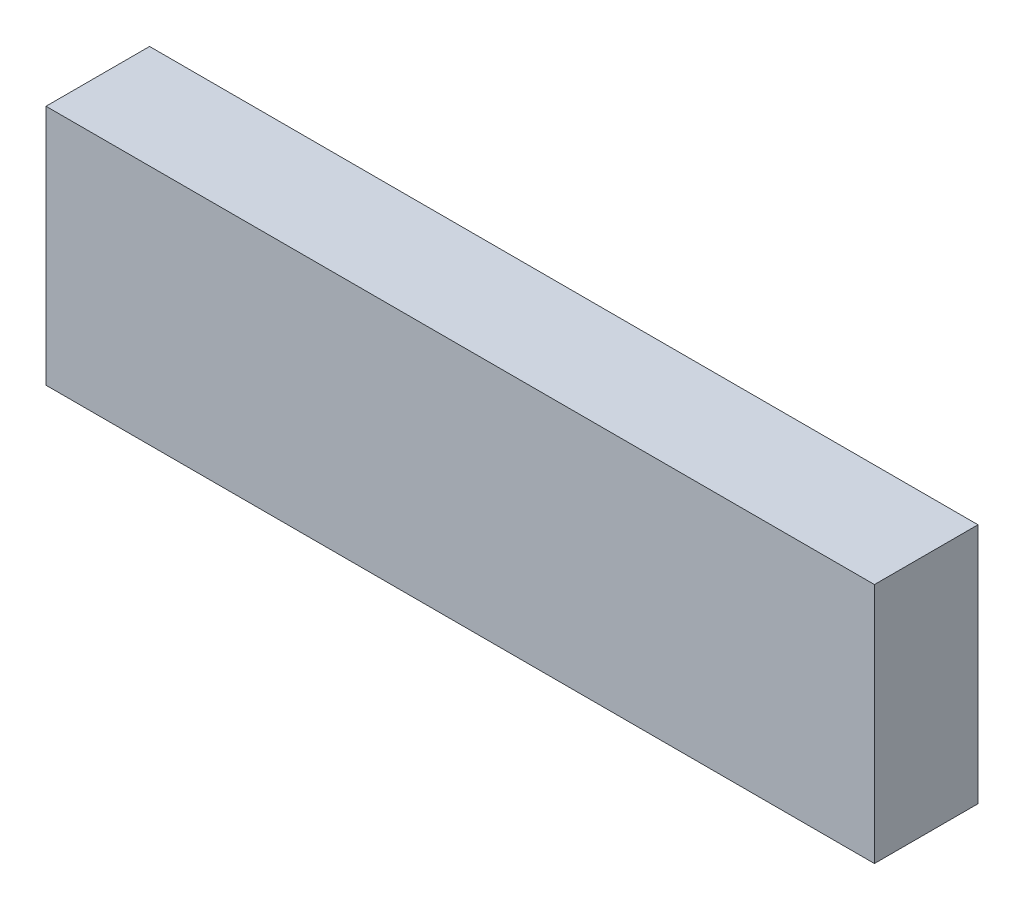
ISO-10303-21;
HEADER;
FILE_DESCRIPTION(('STEP AP214'),'2;1');
FILE_NAME('part.step','',(''),(''),'','','');
FILE_SCHEMA(('AUTOMOTIVE_DESIGN { 1 0 10303 214 1 1 1 1 }'));
ENDSEC;
DATA;
#1=APPLICATION_CONTEXT('core data for automotive mechanical design processes');
#2=APPLICATION_PROTOCOL_DEFINITION('international standard','automotive_design',2000,#1);
#3=PRODUCT_CONTEXT('',#1,'mechanical');
#4=PRODUCT('Part','Part','',(#3));
#5=PRODUCT_RELATED_PRODUCT_CATEGORY('part','',(#4));
#6=PRODUCT_DEFINITION_FORMATION('','',#4);
#7=PRODUCT_DEFINITION_CONTEXT('part definition',#1,'design');
#8=PRODUCT_DEFINITION('design','',#6,#7);
#9=PRODUCT_DEFINITION_SHAPE('','',#8);
#10=(LENGTH_UNIT() NAMED_UNIT(*) SI_UNIT(.MILLI.,.METRE.));
#11=(NAMED_UNIT(*) PLANE_ANGLE_UNIT() SI_UNIT($,.RADIAN.));
#12=(NAMED_UNIT(*) SI_UNIT($,.STERADIAN.) SOLID_ANGLE_UNIT());
#13=UNCERTAINTY_MEASURE_WITH_UNIT(LENGTH_MEASURE(1.E-05),#10,'distance_accuracy_value','');
#14=(GEOMETRIC_REPRESENTATION_CONTEXT(3) GLOBAL_UNCERTAINTY_ASSIGNED_CONTEXT((#13)) GLOBAL_UNIT_ASSIGNED_CONTEXT((#10,
#11,#12)) REPRESENTATION_CONTEXT('',''));
#15=CARTESIAN_POINT('',(0.,0.,0.));
#16=DIRECTION('',(0.,0.,1.));
#17=DIRECTION('',(1.,0.,0.));
#18=AXIS2_PLACEMENT_3D('',#15,#16,#17);
#19=CARTESIAN_POINT('',(304.8,-44.45,-19.05));
#20=DIRECTION('',(0.,0.,1.));
#21=DIRECTION('',(1.,0.,0.));
#22=AXIS2_PLACEMENT_3D('',#19,#20,#21);
#23=PLANE('',#22);
#24=DIRECTION('',(0.,1.,0.));
#25=VECTOR('',#24,1.);
#26=CARTESIAN_POINT('',(0.,-44.45,-19.05));
#27=LINE('',#26,#25);
#28=CARTESIAN_POINT('',(0.,-44.45,-19.05));
#29=VERTEX_POINT('',#28);
#30=CARTESIAN_POINT('',(0.,44.45,-19.05));
#31=VERTEX_POINT('',#30);
#32=EDGE_CURVE('E96',#29,#31,#27,.T.);
#33=ORIENTED_EDGE('',*,*,#32,.T.);
#34=DIRECTION('',(-1.,0.,0.));
#35=VECTOR('',#34,1.);
#36=CARTESIAN_POINT('',(304.8,44.45,-19.05));
#37=LINE('',#36,#35);
#38=CARTESIAN_POINT('',(304.8,44.45,-19.05));
#39=VERTEX_POINT('',#38);
#40=EDGE_CURVE('E11',#39,#31,#37,.T.);
#41=ORIENTED_EDGE('',*,*,#40,.F.);
#42=DIRECTION('',(0.,1.,0.));
#43=VECTOR('',#42,1.);
#44=CARTESIAN_POINT('',(304.8,-44.45,-19.05));
#45=LINE('',#44,#43);
#46=CARTESIAN_POINT('',(304.8,-44.45,-19.05));
#47=VERTEX_POINT('',#46);
#48=EDGE_CURVE('E84',#47,#39,#45,.T.);
#49=ORIENTED_EDGE('',*,*,#48,.F.);
#50=DIRECTION('',(-1.,0.,0.));
#51=VECTOR('',#50,1.);
#52=CARTESIAN_POINT('',(304.8,-44.45,-19.05));
#53=LINE('',#52,#51);
#54=EDGE_CURVE('E92',#47,#29,#53,.T.);
#55=ORIENTED_EDGE('',*,*,#54,.T.);
#56=EDGE_LOOP('',(#33,#41,#49,#55));
#57=FACE_BOUND('',#56,.T.);
#58=ADVANCED_FACE('F33',(#57),#23,.F.);
#59=CARTESIAN_POINT('',(304.8,44.45,19.05));
#60=DIRECTION('',(0.,-1.,0.));
#61=DIRECTION('',(0.,0.,-1.));
#62=AXIS2_PLACEMENT_3D('',#59,#60,#61);
#63=PLANE('',#62);
#64=DIRECTION('',(0.,0.,1.));
#65=VECTOR('',#64,1.);
#66=CARTESIAN_POINT('',(0.,44.45,19.05));
#67=LINE('',#66,#65);
#68=CARTESIAN_POINT('',(0.,44.45,19.05));
#69=VERTEX_POINT('',#68);
#70=EDGE_CURVE('E88',#31,#69,#67,.T.);
#71=ORIENTED_EDGE('',*,*,#70,.T.);
#72=DIRECTION('',(-1.,0.,0.));
#73=VECTOR('',#72,1.);
#74=CARTESIAN_POINT('',(304.8,44.45,19.05));
#75=LINE('',#74,#73);
#76=CARTESIAN_POINT('',(304.8,44.45,19.05));
#77=VERTEX_POINT('',#76);
#78=EDGE_CURVE('E41',#77,#69,#75,.T.);
#79=ORIENTED_EDGE('',*,*,#78,.F.);
#80=DIRECTION('',(0.,0.,1.));
#81=VECTOR('',#80,1.);
#82=CARTESIAN_POINT('',(304.8,44.45,19.05));
#83=LINE('',#82,#81);
#84=EDGE_CURVE('E79',#39,#77,#83,.T.);
#85=ORIENTED_EDGE('',*,*,#84,.F.);
#86=ORIENTED_EDGE('',*,*,#40,.T.);
#87=EDGE_LOOP('',(#71,#79,#85,#86));
#88=FACE_BOUND('',#87,.T.);
#89=ADVANCED_FACE('F87',(#88),#63,.F.);
#90=CARTESIAN_POINT('',(304.8,-44.45,19.05));
#91=DIRECTION('',(0.,0.,-1.));
#92=DIRECTION('',(-1.,0.,0.));
#93=AXIS2_PLACEMENT_3D('',#90,#91,#92);
#94=PLANE('',#93);
#95=DIRECTION('',(0.,-1.,0.));
#96=VECTOR('',#95,1.);
#97=CARTESIAN_POINT('',(0.,-44.45,19.05));
#98=LINE('',#97,#96);
#99=CARTESIAN_POINT('',(0.,-44.45,19.05));
#100=VERTEX_POINT('',#99);
#101=EDGE_CURVE('E66',#69,#100,#98,.T.);
#102=ORIENTED_EDGE('',*,*,#101,.T.);
#103=DIRECTION('',(-1.,0.,0.));
#104=VECTOR('',#103,1.);
#105=CARTESIAN_POINT('',(304.8,-44.45,19.05));
#106=LINE('',#105,#104);
#107=CARTESIAN_POINT('',(304.8,-44.45,19.05));
#108=VERTEX_POINT('',#107);
#109=EDGE_CURVE('E89',#108,#100,#106,.T.);
#110=ORIENTED_EDGE('',*,*,#109,.F.);
#111=DIRECTION('',(0.,-1.,0.));
#112=VECTOR('',#111,1.);
#113=CARTESIAN_POINT('',(304.8,-44.45,19.05));
#114=LINE('',#113,#112);
#115=EDGE_CURVE('E82',#77,#108,#114,.T.);
#116=ORIENTED_EDGE('',*,*,#115,.F.);
#117=ORIENTED_EDGE('',*,*,#78,.T.);
#118=EDGE_LOOP('',(#102,#110,#116,#117));
#119=FACE_BOUND('',#118,.T.);
#120=ADVANCED_FACE('F90',(#119),#94,.F.);
#121=CARTESIAN_POINT('',(304.8,-44.45,19.05));
#122=DIRECTION('',(0.,1.,0.));
#123=DIRECTION('',(0.,0.,1.));
#124=AXIS2_PLACEMENT_3D('',#121,#122,#123);
#125=PLANE('',#124);
#126=DIRECTION('',(0.,0.,-1.));
#127=VECTOR('',#126,1.);
#128=CARTESIAN_POINT('',(0.,-44.45,19.05));
#129=LINE('',#128,#127);
#130=EDGE_CURVE('E72',#100,#29,#129,.T.);
#131=ORIENTED_EDGE('',*,*,#130,.T.);
#132=ORIENTED_EDGE('',*,*,#54,.F.);
#133=DIRECTION('',(0.,0.,-1.));
#134=VECTOR('',#133,1.);
#135=CARTESIAN_POINT('',(304.8,-44.45,19.05));
#136=LINE('',#135,#134);
#137=EDGE_CURVE('E49',#108,#47,#136,.T.);
#138=ORIENTED_EDGE('',*,*,#137,.F.);
#139=ORIENTED_EDGE('',*,*,#109,.T.);
#140=EDGE_LOOP('',(#131,#132,#138,#139));
#141=FACE_BOUND('',#140,.T.);
#142=ADVANCED_FACE('F103',(#141),#125,.F.);
#143=CARTESIAN_POINT('',(304.8,0.,0.));
#144=DIRECTION('',(-1.,0.,0.));
#145=DIRECTION('',(0.,0.,1.));
#146=AXIS2_PLACEMENT_3D('',#143,#144,#145);
#147=PLANE('',#146);
#148=ORIENTED_EDGE('',*,*,#48,.T.);
#149=ORIENTED_EDGE('',*,*,#84,.T.);
#150=ORIENTED_EDGE('',*,*,#115,.T.);
#151=ORIENTED_EDGE('',*,*,#137,.T.);
#152=EDGE_LOOP('',(#148,#149,#150,#151));
#153=FACE_BOUND('',#152,.T.);
#154=ADVANCED_FACE('F80',(#153),#147,.F.);
#155=CARTESIAN_POINT('',(0.,0.,0.));
#156=DIRECTION('',(-1.,0.,0.));
#157=DIRECTION('',(0.,0.,1.));
#158=AXIS2_PLACEMENT_3D('',#155,#156,#157);
#159=PLANE('',#158);
#160=ORIENTED_EDGE('',*,*,#32,.F.);
#161=ORIENTED_EDGE('',*,*,#130,.F.);
#162=ORIENTED_EDGE('',*,*,#101,.F.);
#163=ORIENTED_EDGE('',*,*,#70,.F.);
#164=EDGE_LOOP('',(#160,#161,#162,#163));
#165=FACE_BOUND('',#164,.T.);
#166=ADVANCED_FACE('F106',(#165),#159,.T.);
#167=CLOSED_SHELL('',(#58,#89,#120,#142,#154,#166));
#168=MANIFOLD_SOLID_BREP('B2',#167);
#169=ADVANCED_BREP_SHAPE_REPRESENTATION('',(#18,#168),#14);
#170=SHAPE_DEFINITION_REPRESENTATION(#9,#169);
ENDSEC;
END-ISO-10303-21;
